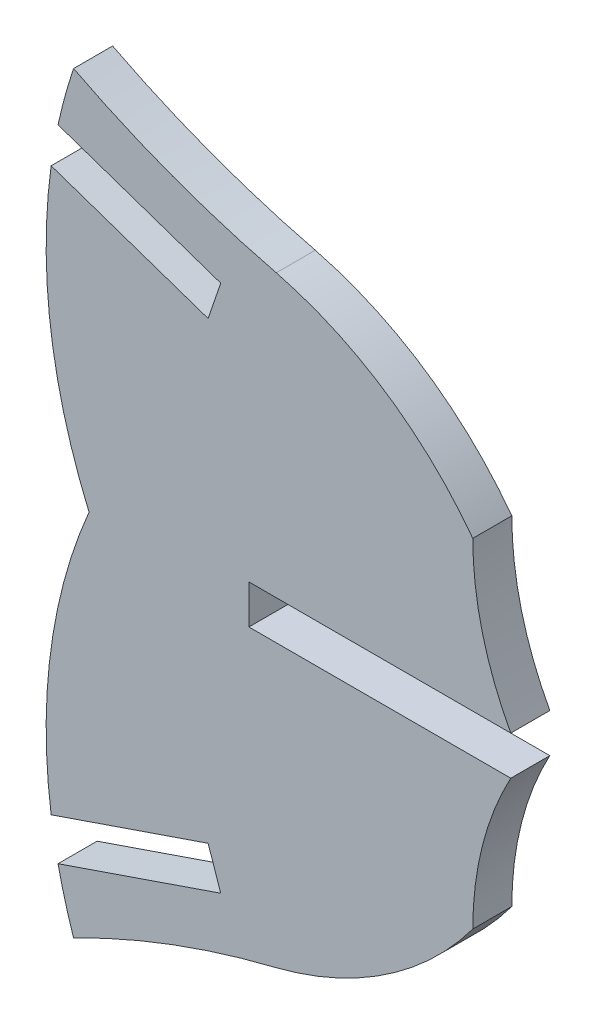
ISO-10303-21;
HEADER;
FILE_DESCRIPTION(('STEP AP214'),'2;1');
FILE_NAME('part.step','',(''),(''),'','','');
FILE_SCHEMA(('AUTOMOTIVE_DESIGN { 1 0 10303 214 1 1 1 1 }'));
ENDSEC;
DATA;
#1=APPLICATION_CONTEXT('core data for automotive mechanical design processes');
#2=APPLICATION_PROTOCOL_DEFINITION('international standard','automotive_design',2000,#1);
#3=PRODUCT_CONTEXT('',#1,'mechanical');
#4=PRODUCT('Part','Part','',(#3));
#5=PRODUCT_RELATED_PRODUCT_CATEGORY('part','',(#4));
#6=PRODUCT_DEFINITION_FORMATION('','',#4);
#7=PRODUCT_DEFINITION_CONTEXT('part definition',#1,'design');
#8=PRODUCT_DEFINITION('design','',#6,#7);
#9=PRODUCT_DEFINITION_SHAPE('','',#8);
#10=(LENGTH_UNIT() NAMED_UNIT(*) SI_UNIT(.MILLI.,.METRE.));
#11=(NAMED_UNIT(*) PLANE_ANGLE_UNIT() SI_UNIT($,.RADIAN.));
#12=(NAMED_UNIT(*) SI_UNIT($,.STERADIAN.) SOLID_ANGLE_UNIT());
#13=UNCERTAINTY_MEASURE_WITH_UNIT(LENGTH_MEASURE(1.E-05),#10,'distance_accuracy_value','');
#14=(GEOMETRIC_REPRESENTATION_CONTEXT(3) GLOBAL_UNCERTAINTY_ASSIGNED_CONTEXT((#13)) GLOBAL_UNIT_ASSIGNED_CONTEXT((#10,
#11,#12)) REPRESENTATION_CONTEXT('',''));
#15=CARTESIAN_POINT('',(0.,0.,0.));
#16=DIRECTION('',(0.,0.,1.));
#17=DIRECTION('',(1.,0.,0.));
#18=AXIS2_PLACEMENT_3D('',#15,#16,#17);
#19=CARTESIAN_POINT('',(0.285426681727199,0.,1.524));
#20=DIRECTION('',(0.,1.,0.));
#21=DIRECTION('',(-1.,0.,0.));
#22=AXIS2_PLACEMENT_3D('',#19,#20,#21);
#23=PLANE('',#22);
#24=DIRECTION('',(1.,0.,0.));
#25=VECTOR('',#24,1.);
#26=CARTESIAN_POINT('',(0.285426681727199,0.,0.));
#27=LINE('',#26,#25);
#28=CARTESIAN_POINT('',(0.285426681727199,0.,0.));
#29=VERTEX_POINT('',#28);
#30=CARTESIAN_POINT('',(10.5084019228627,0.,0.));
#31=VERTEX_POINT('',#30);
#32=EDGE_CURVE('E195',#29,#31,#27,.T.);
#33=ORIENTED_EDGE('',*,*,#32,.T.);
#34=DIRECTION('',(0.,0.,-1.));
#35=VECTOR('',#34,1.);
#36=CARTESIAN_POINT('',(10.5084019228627,0.,1.524));
#37=LINE('',#36,#35);
#38=CARTESIAN_POINT('',(10.5084019228627,0.,1.524));
#39=VERTEX_POINT('',#38);
#40=EDGE_CURVE('E11',#39,#31,#37,.T.);
#41=ORIENTED_EDGE('',*,*,#40,.F.);
#42=DIRECTION('',(1.,0.,0.));
#43=VECTOR('',#42,1.);
#44=CARTESIAN_POINT('',(0.285426681727199,0.,1.524));
#45=LINE('',#44,#43);
#46=CARTESIAN_POINT('',(0.285426681727199,0.,1.524));
#47=VERTEX_POINT('',#46);
#48=EDGE_CURVE('E231',#47,#39,#45,.T.);
#49=ORIENTED_EDGE('',*,*,#48,.F.);
#50=DIRECTION('',(0.,0.,-1.));
#51=VECTOR('',#50,1.);
#52=CARTESIAN_POINT('',(0.285426681727199,0.,1.524));
#53=LINE('',#52,#51);
#54=EDGE_CURVE('E191',#47,#29,#53,.T.);
#55=ORIENTED_EDGE('',*,*,#54,.T.);
#56=EDGE_LOOP('',(#33,#41,#49,#55));
#57=FACE_BOUND('',#56,.T.);
#58=ADVANCED_FACE('F33',(#57),#23,.F.);
#59=CARTESIAN_POINT('',(21.2674310646447,5.84217819092027,1.524));
#60=DIRECTION('',(0.,0.,-1.));
#61=DIRECTION('',(-1.,0.,0.));
#62=AXIS2_PLACEMENT_3D('',#59,#60,#61);
#63=CYLINDRICAL_SURFACE('',#62,12.2428654361705);
#64=CARTESIAN_POINT('',(21.2674310646447,5.84217819092027,0.));
#65=DIRECTION('',(0.,0.,-1.));
#66=DIRECTION('',(-1.,0.,0.));
#67=AXIS2_PLACEMENT_3D('',#64,#65,#66);
#68=CIRCLE('',#67,12.2428654361705);
#69=CARTESIAN_POINT('',(9.0245656284742,5.84217819092036,0.));
#70=VERTEX_POINT('',#69);
#71=EDGE_CURVE('E198',#31,#70,#68,.T.);
#72=ORIENTED_EDGE('',*,*,#71,.T.);
#73=DIRECTION('',(0.,0.,-1.));
#74=VECTOR('',#73,1.);
#75=CARTESIAN_POINT('',(9.0245656284742,5.84217819092036,1.524));
#76=LINE('',#75,#74);
#77=CARTESIAN_POINT('',(9.0245656284742,5.84217819092036,1.524));
#78=VERTEX_POINT('',#77);
#79=EDGE_CURVE('E41',#78,#70,#76,.T.);
#80=ORIENTED_EDGE('',*,*,#79,.F.);
#81=CARTESIAN_POINT('',(21.2674310646447,5.84217819092027,1.524));
#82=DIRECTION('',(0.,0.,-1.));
#83=DIRECTION('',(-1.,0.,0.));
#84=AXIS2_PLACEMENT_3D('',#81,#82,#83);
#85=CIRCLE('',#84,12.2428654361705);
#86=EDGE_CURVE('E125',#39,#78,#85,.T.);
#87=ORIENTED_EDGE('',*,*,#86,.F.);
#88=ORIENTED_EDGE('',*,*,#40,.T.);
#89=EDGE_LOOP('',(#72,#80,#87,#88));
#90=FACE_BOUND('',#89,.T.);
#91=ADVANCED_FACE('F344',(#90),#63,.F.);
#92=CARTESIAN_POINT('',(-2.04585475702059,-2.37697347672963,1.524));
#93=DIRECTION('',(0.,0.,-1.));
#94=DIRECTION('',(-1.,0.,0.));
#95=AXIS2_PLACEMENT_3D('',#92,#93,#94);
#96=CYLINDRICAL_SURFACE('',#95,13.7879897609264);
#97=CARTESIAN_POINT('',(-2.04585475702059,-2.37697347672963,0.));
#98=DIRECTION('',(0.,0.,1.));
#99=DIRECTION('',(-1.,0.,0.));
#100=AXIS2_PLACEMENT_3D('',#97,#98,#99);
#101=CIRCLE('',#100,13.7879897609264);
#102=CARTESIAN_POINT('',(1.35365075137161,10.9853625445588,0.));
#103=VERTEX_POINT('',#102);
#104=EDGE_CURVE('E200',#70,#103,#101,.T.);
#105=ORIENTED_EDGE('',*,*,#104,.T.);
#106=DIRECTION('',(0.,0.,-1.));
#107=VECTOR('',#106,1.);
#108=CARTESIAN_POINT('',(1.35365075137161,10.9853625445588,1.524));
#109=LINE('',#108,#107);
#110=CARTESIAN_POINT('',(1.35365075137161,10.9853625445588,1.524));
#111=VERTEX_POINT('',#110);
#112=EDGE_CURVE('E271',#111,#103,#109,.T.);
#113=ORIENTED_EDGE('',*,*,#112,.F.);
#114=CARTESIAN_POINT('',(-2.04585475702059,-2.37697347672963,1.524));
#115=DIRECTION('',(0.,0.,1.));
#116=DIRECTION('',(-1.,0.,0.));
#117=AXIS2_PLACEMENT_3D('',#114,#115,#116);
#118=CIRCLE('',#117,13.7879897609264);
#119=EDGE_CURVE('E279',#78,#111,#118,.T.);
#120=ORIENTED_EDGE('',*,*,#119,.F.);
#121=ORIENTED_EDGE('',*,*,#79,.T.);
#122=EDGE_LOOP('',(#105,#113,#120,#121));
#123=FACE_BOUND('',#122,.T.);
#124=ADVANCED_FACE('F277',(#123),#96,.T.);
#125=CARTESIAN_POINT('',(9.96398661820152,46.1957399070621,1.524));
#126=DIRECTION('',(0.,0.,-1.));
#127=DIRECTION('',(-1.,0.,0.));
#128=AXIS2_PLACEMENT_3D('',#125,#126,#127);
#129=CYLINDRICAL_SURFACE('',#128,36.2478765964229);
#130=CARTESIAN_POINT('',(9.96398661820152,46.1957399070621,0.));
#131=DIRECTION('',(0.,0.,-1.));
#132=DIRECTION('',(1.,0.,0.));
#133=AXIS2_PLACEMENT_3D('',#130,#131,#132);
#134=CIRCLE('',#133,36.2478765964229);
#135=CARTESIAN_POINT('',(-6.55922440239465,13.9328811478271,0.));
#136=VERTEX_POINT('',#135);
#137=EDGE_CURVE('E202',#103,#136,#134,.T.);
#138=ORIENTED_EDGE('',*,*,#137,.T.);
#139=DIRECTION('',(0.,0.,-1.));
#140=VECTOR('',#139,1.);
#141=CARTESIAN_POINT('',(-6.55922440239465,13.9328811478271,1.524));
#142=LINE('',#141,#140);
#143=CARTESIAN_POINT('',(-6.55922440239465,13.9328811478271,1.524));
#144=VERTEX_POINT('',#143);
#145=EDGE_CURVE('E268',#144,#136,#142,.T.);
#146=ORIENTED_EDGE('',*,*,#145,.F.);
#147=CARTESIAN_POINT('',(9.96398661820152,46.1957399070621,1.524));
#148=DIRECTION('',(0.,0.,-1.));
#149=DIRECTION('',(1.,0.,0.));
#150=AXIS2_PLACEMENT_3D('',#147,#148,#149);
#151=CIRCLE('',#150,36.2478765964229);
#152=EDGE_CURVE('E297',#111,#144,#151,.T.);
#153=ORIENTED_EDGE('',*,*,#152,.F.);
#154=ORIENTED_EDGE('',*,*,#112,.T.);
#155=EDGE_LOOP('',(#138,#146,#153,#154));
#156=FACE_BOUND('',#155,.T.);
#157=ADVANCED_FACE('F288',(#156),#129,.F.);
#158=CARTESIAN_POINT('',(12.9854145326521,7.37668259635203,1.524));
#159=DIRECTION('',(0.,0.,-1.));
#160=DIRECTION('',(-1.,0.,0.));
#161=AXIS2_PLACEMENT_3D('',#158,#159,#160);
#162=CYLINDRICAL_SURFACE('',#161,20.6149618129093);
#163=CARTESIAN_POINT('',(12.9854145326521,7.37668259635203,0.));
#164=DIRECTION('',(0.,0.,1.));
#165=DIRECTION('',(1.,0.,0.));
#166=AXIS2_PLACEMENT_3D('',#163,#164,#165);
#167=CIRCLE('',#166,20.6149618129093);
#168=CARTESIAN_POINT('',(-7.16516219998669,11.727648913131,0.));
#169=VERTEX_POINT('',#168);
#170=EDGE_CURVE('E204',#136,#169,#167,.T.);
#171=ORIENTED_EDGE('',*,*,#170,.T.);
#172=DIRECTION('',(0.,0.,-1.));
#173=VECTOR('',#172,1.);
#174=CARTESIAN_POINT('',(-7.16516219998669,11.727648913131,1.524));
#175=LINE('',#174,#173);
#176=CARTESIAN_POINT('',(-7.16516219998669,11.727648913131,1.524));
#177=VERTEX_POINT('',#176);
#178=EDGE_CURVE('E265',#177,#169,#175,.T.);
#179=ORIENTED_EDGE('',*,*,#178,.F.);
#180=CARTESIAN_POINT('',(12.9854145326521,7.37668259635203,1.524));
#181=DIRECTION('',(0.,0.,1.));
#182=DIRECTION('',(1.,0.,0.));
#183=AXIS2_PLACEMENT_3D('',#180,#181,#182);
#184=CIRCLE('',#183,20.6149618129093);
#185=EDGE_CURVE('E294',#144,#177,#184,.T.);
#186=ORIENTED_EDGE('',*,*,#185,.F.);
#187=ORIENTED_EDGE('',*,*,#145,.T.);
#188=EDGE_LOOP('',(#171,#179,#186,#187));
#189=FACE_BOUND('',#188,.T.);
#190=ADVANCED_FACE('F292',(#189),#162,.T.);
#191=CARTESIAN_POINT('',(-7.16516219998669,11.727648913131,1.524));
#192=DIRECTION('',(0.324231129631645,0.945977893281755,0.));
#193=DIRECTION('',(-0.945977893281755,0.324231129631645,0.));
#194=AXIS2_PLACEMENT_3D('',#191,#192,#193);
#195=PLANE('',#194);
#196=DIRECTION('',(0.945977893281755,-0.324231129631645,0.));
#197=VECTOR('',#196,1.);
#198=CARTESIAN_POINT('',(-7.16516219998669,11.727648913131,0.));
#199=LINE('',#198,#197);
#200=CARTESIAN_POINT('',(-0.813548274939549,9.55065199541469,0.));
#201=VERTEX_POINT('',#200);
#202=EDGE_CURVE('E206',#169,#201,#199,.T.);
#203=ORIENTED_EDGE('',*,*,#202,.T.);
#204=DIRECTION('',(0.,0.,-1.));
#205=VECTOR('',#204,1.);
#206=CARTESIAN_POINT('',(-0.813548274939549,9.55065199541469,1.524));
#207=LINE('',#206,#205);
#208=CARTESIAN_POINT('',(-0.813548274939549,9.55065199541469,1.524));
#209=VERTEX_POINT('',#208);
#210=EDGE_CURVE('E262',#209,#201,#207,.T.);
#211=ORIENTED_EDGE('',*,*,#210,.F.);
#212=DIRECTION('',(0.945977893281755,-0.324231129631645,0.));
#213=VECTOR('',#212,1.);
#214=CARTESIAN_POINT('',(-7.16516219998669,11.727648913131,1.524));
#215=LINE('',#214,#213);
#216=EDGE_CURVE('E296',#177,#209,#215,.T.);
#217=ORIENTED_EDGE('',*,*,#216,.F.);
#218=ORIENTED_EDGE('',*,*,#178,.T.);
#219=EDGE_LOOP('',(#203,#211,#217,#218));
#220=FACE_BOUND('',#219,.T.);
#221=ADVANCED_FACE('F357',(#220),#195,.F.);
#222=CARTESIAN_POINT('',(-0.813548274939549,9.55065199541469,1.524));
#223=DIRECTION('',(0.945977893281755,-0.324231129631645,0.));
#224=DIRECTION('',(0.324231129631645,0.945977893281755,0.));
#225=AXIS2_PLACEMENT_3D('',#222,#223,#224);
#226=PLANE('',#225);
#227=DIRECTION('',(-0.324231129631645,-0.945977893281755,0.));
#228=VECTOR('',#227,1.);
#229=CARTESIAN_POINT('',(-0.813548274939549,9.55065199541469,0.));
#230=LINE('',#229,#228);
#231=CARTESIAN_POINT('',(-1.30767651649818,8.1089816860533,0.));
#232=VERTEX_POINT('',#231);
#233=EDGE_CURVE('E208',#201,#232,#230,.T.);
#234=ORIENTED_EDGE('',*,*,#233,.T.);
#235=DIRECTION('',(0.,0.,-1.));
#236=VECTOR('',#235,1.);
#237=CARTESIAN_POINT('',(-1.30767651649818,8.1089816860533,1.524));
#238=LINE('',#237,#236);
#239=CARTESIAN_POINT('',(-1.30767651649818,8.1089816860533,1.524));
#240=VERTEX_POINT('',#239);
#241=EDGE_CURVE('E259',#240,#232,#238,.T.);
#242=ORIENTED_EDGE('',*,*,#241,.F.);
#243=DIRECTION('',(-0.324231129631645,-0.945977893281755,0.));
#244=VECTOR('',#243,1.);
#245=CARTESIAN_POINT('',(-0.813548274939549,9.55065199541469,1.524));
#246=LINE('',#245,#244);
#247=EDGE_CURVE('E299',#209,#240,#246,.T.);
#248=ORIENTED_EDGE('',*,*,#247,.F.);
#249=ORIENTED_EDGE('',*,*,#210,.T.);
#250=EDGE_LOOP('',(#234,#242,#248,#249));
#251=FACE_BOUND('',#250,.T.);
#252=ADVANCED_FACE('F360',(#251),#226,.F.);
#253=CARTESIAN_POINT('',(-7.4340816445076,10.2087889535831,1.524));
#254=DIRECTION('',(-0.324231129631645,-0.945977893281755,0.));
#255=DIRECTION('',(0.945977893281755,-0.324231129631645,0.));
#256=AXIS2_PLACEMENT_3D('',#253,#254,#255);
#257=PLANE('',#256);
#258=DIRECTION('',(-0.945977893281755,0.324231129631645,0.));
#259=VECTOR('',#258,1.);
#260=CARTESIAN_POINT('',(-7.4340816445076,10.2087889535831,0.));
#261=LINE('',#260,#259);
#262=CARTESIAN_POINT('',(-7.4340816445076,10.2087889535831,0.));
#263=VERTEX_POINT('',#262);
#264=EDGE_CURVE('E210',#232,#263,#261,.T.);
#265=ORIENTED_EDGE('',*,*,#264,.T.);
#266=DIRECTION('',(0.,0.,-1.));
#267=VECTOR('',#266,1.);
#268=CARTESIAN_POINT('',(-7.4340816445076,10.2087889535831,1.524));
#269=LINE('',#268,#267);
#270=CARTESIAN_POINT('',(-7.4340816445076,10.2087889535831,1.524));
#271=VERTEX_POINT('',#270);
#272=EDGE_CURVE('E256',#271,#263,#269,.T.);
#273=ORIENTED_EDGE('',*,*,#272,.F.);
#274=DIRECTION('',(-0.945977893281755,0.324231129631645,0.));
#275=VECTOR('',#274,1.);
#276=CARTESIAN_POINT('',(-7.4340816445076,10.2087889535831,1.524));
#277=LINE('',#276,#275);
#278=EDGE_CURVE('E305',#240,#271,#277,.T.);
#279=ORIENTED_EDGE('',*,*,#278,.F.);
#280=ORIENTED_EDGE('',*,*,#241,.T.);
#281=EDGE_LOOP('',(#265,#273,#279,#280));
#282=FACE_BOUND('',#281,.T.);
#283=ADVANCED_FACE('F364',(#282),#257,.F.);
#284=CARTESIAN_POINT('',(12.9854145326521,7.37668259635203,1.524));
#285=DIRECTION('',(0.,0.,-1.));
#286=DIRECTION('',(-1.,0.,0.));
#287=AXIS2_PLACEMENT_3D('',#284,#285,#286);
#288=CYLINDRICAL_SURFACE('',#287,20.6149618129093);
#289=CARTESIAN_POINT('',(12.9854145326521,7.37668259635203,0.));
#290=DIRECTION('',(0.,0.,1.));
#291=DIRECTION('',(1.,0.,0.));
#292=AXIS2_PLACEMENT_3D('',#289,#290,#291);
#293=CIRCLE('',#292,20.6149618129093);
#294=CARTESIAN_POINT('',(-5.9549787088713,-0.762000000000002,0.));
#295=VERTEX_POINT('',#294);
#296=EDGE_CURVE('E212',#263,#295,#293,.T.);
#297=ORIENTED_EDGE('',*,*,#296,.T.);
#298=DIRECTION('',(0.,0.,-1.));
#299=VECTOR('',#298,1.);
#300=CARTESIAN_POINT('',(-5.9549787088713,-0.762000000000002,1.524));
#301=LINE('',#300,#299);
#302=CARTESIAN_POINT('',(-5.9549787088713,-0.762000000000002,1.524));
#303=VERTEX_POINT('',#302);
#304=EDGE_CURVE('E253',#303,#295,#301,.T.);
#305=ORIENTED_EDGE('',*,*,#304,.F.);
#306=CARTESIAN_POINT('',(12.9854145326521,7.37668259635203,1.524));
#307=DIRECTION('',(0.,0.,1.));
#308=DIRECTION('',(1.,0.,0.));
#309=AXIS2_PLACEMENT_3D('',#306,#307,#308);
#310=CIRCLE('',#309,20.6149618129093);
#311=EDGE_CURVE('E307',#271,#303,#310,.T.);
#312=ORIENTED_EDGE('',*,*,#311,.F.);
#313=ORIENTED_EDGE('',*,*,#272,.T.);
#314=EDGE_LOOP('',(#297,#305,#312,#313));
#315=FACE_BOUND('',#314,.T.);
#316=ADVANCED_FACE('F368',(#315),#288,.T.);
#317=CARTESIAN_POINT('',(12.9854145326521,-8.90068259635203,1.524));
#318=DIRECTION('',(0.,0.,-1.));
#319=DIRECTION('',(-1.,0.,0.));
#320=AXIS2_PLACEMENT_3D('',#317,#318,#319);
#321=CYLINDRICAL_SURFACE('',#320,20.6149618129093);
#322=CARTESIAN_POINT('',(12.9854145326521,-8.90068259635203,0.));
#323=DIRECTION('',(0.,0.,1.));
#324=DIRECTION('',(-1.,0.,0.));
#325=AXIS2_PLACEMENT_3D('',#322,#323,#324);
#326=CIRCLE('',#325,20.6149618129093);
#327=CARTESIAN_POINT('',(-7.4340816445076,-11.7327889535831,0.));
#328=VERTEX_POINT('',#327);
#329=EDGE_CURVE('E214',#295,#328,#326,.T.);
#330=ORIENTED_EDGE('',*,*,#329,.T.);
#331=DIRECTION('',(0.,0.,-1.));
#332=VECTOR('',#331,1.);
#333=CARTESIAN_POINT('',(-7.4340816445076,-11.7327889535831,1.524));
#334=LINE('',#333,#332);
#335=CARTESIAN_POINT('',(-7.4340816445076,-11.7327889535831,1.524));
#336=VERTEX_POINT('',#335);
#337=EDGE_CURVE('E250',#336,#328,#334,.T.);
#338=ORIENTED_EDGE('',*,*,#337,.F.);
#339=CARTESIAN_POINT('',(12.9854145326521,-8.90068259635203,1.524));
#340=DIRECTION('',(0.,0.,1.));
#341=DIRECTION('',(-1.,0.,0.));
#342=AXIS2_PLACEMENT_3D('',#339,#340,#341);
#343=CIRCLE('',#342,20.6149618129093);
#344=EDGE_CURVE('E309',#303,#336,#343,.T.);
#345=ORIENTED_EDGE('',*,*,#344,.F.);
#346=ORIENTED_EDGE('',*,*,#304,.T.);
#347=EDGE_LOOP('',(#330,#338,#345,#346));
#348=FACE_BOUND('',#347,.T.);
#349=ADVANCED_FACE('F372',(#348),#321,.T.);
#350=CARTESIAN_POINT('',(-7.4340816445076,-11.7327889535831,1.524));
#351=DIRECTION('',(-0.324231129631645,0.945977893281755,0.));
#352=DIRECTION('',(-0.945977893281755,-0.324231129631645,0.));
#353=AXIS2_PLACEMENT_3D('',#350,#351,#352);
#354=PLANE('',#353);
#355=DIRECTION('',(0.945977893281755,0.324231129631645,0.));
#356=VECTOR('',#355,1.);
#357=CARTESIAN_POINT('',(-7.4340816445076,-11.7327889535831,0.));
#358=LINE('',#357,#356);
#359=CARTESIAN_POINT('',(-1.30767651649818,-9.6329816860533,0.));
#360=VERTEX_POINT('',#359);
#361=EDGE_CURVE('E216',#328,#360,#358,.T.);
#362=ORIENTED_EDGE('',*,*,#361,.T.);
#363=DIRECTION('',(0.,0.,-1.));
#364=VECTOR('',#363,1.);
#365=CARTESIAN_POINT('',(-1.30767651649818,-9.6329816860533,1.524));
#366=LINE('',#365,#364);
#367=CARTESIAN_POINT('',(-1.30767651649818,-9.6329816860533,1.524));
#368=VERTEX_POINT('',#367);
#369=EDGE_CURVE('E247',#368,#360,#366,.T.);
#370=ORIENTED_EDGE('',*,*,#369,.F.);
#371=DIRECTION('',(0.945977893281755,0.324231129631645,0.));
#372=VECTOR('',#371,1.);
#373=CARTESIAN_POINT('',(-7.4340816445076,-11.7327889535831,1.524));
#374=LINE('',#373,#372);
#375=EDGE_CURVE('E311',#336,#368,#374,.T.);
#376=ORIENTED_EDGE('',*,*,#375,.F.);
#377=ORIENTED_EDGE('',*,*,#337,.T.);
#378=EDGE_LOOP('',(#362,#370,#376,#377));
#379=FACE_BOUND('',#378,.T.);
#380=ADVANCED_FACE('F376',(#379),#354,.F.);
#381=CARTESIAN_POINT('',(-0.813548274939549,-11.0746519954147,1.524));
#382=DIRECTION('',(0.945977893281755,0.324231129631645,0.));
#383=DIRECTION('',(-0.324231129631645,0.945977893281755,0.));
#384=AXIS2_PLACEMENT_3D('',#381,#382,#383);
#385=PLANE('',#384);
#386=DIRECTION('',(0.324231129631645,-0.945977893281755,0.));
#387=VECTOR('',#386,1.);
#388=CARTESIAN_POINT('',(-0.813548274939549,-11.0746519954147,0.));
#389=LINE('',#388,#387);
#390=CARTESIAN_POINT('',(-0.813548274939549,-11.0746519954147,0.));
#391=VERTEX_POINT('',#390);
#392=EDGE_CURVE('E218',#360,#391,#389,.T.);
#393=ORIENTED_EDGE('',*,*,#392,.T.);
#394=DIRECTION('',(0.,0.,-1.));
#395=VECTOR('',#394,1.);
#396=CARTESIAN_POINT('',(-0.813548274939549,-11.0746519954147,1.524));
#397=LINE('',#396,#395);
#398=CARTESIAN_POINT('',(-0.813548274939549,-11.0746519954147,1.524));
#399=VERTEX_POINT('',#398);
#400=EDGE_CURVE('E244',#399,#391,#397,.T.);
#401=ORIENTED_EDGE('',*,*,#400,.F.);
#402=DIRECTION('',(0.324231129631645,-0.945977893281755,0.));
#403=VECTOR('',#402,1.);
#404=CARTESIAN_POINT('',(-0.813548274939549,-11.0746519954147,1.524));
#405=LINE('',#404,#403);
#406=EDGE_CURVE('E313',#368,#399,#405,.T.);
#407=ORIENTED_EDGE('',*,*,#406,.F.);
#408=ORIENTED_EDGE('',*,*,#369,.T.);
#409=EDGE_LOOP('',(#393,#401,#407,#408));
#410=FACE_BOUND('',#409,.T.);
#411=ADVANCED_FACE('F380',(#410),#385,.F.);
#412=CARTESIAN_POINT('',(-7.16516219998669,-13.251648913131,1.524));
#413=DIRECTION('',(0.324231129631645,-0.945977893281755,0.));
#414=DIRECTION('',(0.945977893281755,0.324231129631645,0.));
#415=AXIS2_PLACEMENT_3D('',#412,#413,#414);
#416=PLANE('',#415);
#417=DIRECTION('',(-0.945977893281755,-0.324231129631645,0.));
#418=VECTOR('',#417,1.);
#419=CARTESIAN_POINT('',(-7.16516219998669,-13.251648913131,0.));
#420=LINE('',#419,#418);
#421=CARTESIAN_POINT('',(-7.16516219998669,-13.251648913131,0.));
#422=VERTEX_POINT('',#421);
#423=EDGE_CURVE('E220',#391,#422,#420,.T.);
#424=ORIENTED_EDGE('',*,*,#423,.T.);
#425=DIRECTION('',(0.,0.,-1.));
#426=VECTOR('',#425,1.);
#427=CARTESIAN_POINT('',(-7.16516219998669,-13.251648913131,1.524));
#428=LINE('',#427,#426);
#429=CARTESIAN_POINT('',(-7.16516219998669,-13.251648913131,1.524));
#430=VERTEX_POINT('',#429);
#431=EDGE_CURVE('E241',#430,#422,#428,.T.);
#432=ORIENTED_EDGE('',*,*,#431,.F.);
#433=DIRECTION('',(-0.945977893281755,-0.324231129631645,0.));
#434=VECTOR('',#433,1.);
#435=CARTESIAN_POINT('',(-7.16516219998669,-13.251648913131,1.524));
#436=LINE('',#435,#434);
#437=EDGE_CURVE('E315',#399,#430,#436,.T.);
#438=ORIENTED_EDGE('',*,*,#437,.F.);
#439=ORIENTED_EDGE('',*,*,#400,.T.);
#440=EDGE_LOOP('',(#424,#432,#438,#439));
#441=FACE_BOUND('',#440,.T.);
#442=ADVANCED_FACE('F384',(#441),#416,.F.);
#443=CARTESIAN_POINT('',(12.9854145326521,-8.90068259635203,1.524));
#444=DIRECTION('',(0.,0.,-1.));
#445=DIRECTION('',(-1.,0.,0.));
#446=AXIS2_PLACEMENT_3D('',#443,#444,#445);
#447=CYLINDRICAL_SURFACE('',#446,20.6149618129093);
#448=CARTESIAN_POINT('',(12.9854145326521,-8.90068259635203,0.));
#449=DIRECTION('',(0.,0.,1.));
#450=DIRECTION('',(-1.,0.,0.));
#451=AXIS2_PLACEMENT_3D('',#448,#449,#450);
#452=CIRCLE('',#451,20.6149618129093);
#453=CARTESIAN_POINT('',(-6.55922440239464,-15.4568811478271,0.));
#454=VERTEX_POINT('',#453);
#455=EDGE_CURVE('E222',#422,#454,#452,.T.);
#456=ORIENTED_EDGE('',*,*,#455,.T.);
#457=DIRECTION('',(0.,0.,-1.));
#458=VECTOR('',#457,1.);
#459=CARTESIAN_POINT('',(-6.55922440239464,-15.4568811478271,1.524));
#460=LINE('',#459,#458);
#461=CARTESIAN_POINT('',(-6.55922440239464,-15.4568811478271,1.524));
#462=VERTEX_POINT('',#461);
#463=EDGE_CURVE('E238',#462,#454,#460,.T.);
#464=ORIENTED_EDGE('',*,*,#463,.F.);
#465=CARTESIAN_POINT('',(12.9854145326521,-8.90068259635203,1.524));
#466=DIRECTION('',(0.,0.,1.));
#467=DIRECTION('',(-1.,0.,0.));
#468=AXIS2_PLACEMENT_3D('',#465,#466,#467);
#469=CIRCLE('',#468,20.6149618129093);
#470=EDGE_CURVE('E317',#430,#462,#469,.T.);
#471=ORIENTED_EDGE('',*,*,#470,.F.);
#472=ORIENTED_EDGE('',*,*,#431,.T.);
#473=EDGE_LOOP('',(#456,#464,#471,#472));
#474=FACE_BOUND('',#473,.T.);
#475=ADVANCED_FACE('F388',(#474),#447,.T.);
#476=CARTESIAN_POINT('',(9.96398661820152,-47.7197399070621,1.524));
#477=DIRECTION('',(0.,0.,-1.));
#478=DIRECTION('',(-1.,0.,0.));
#479=AXIS2_PLACEMENT_3D('',#476,#477,#478);
#480=CYLINDRICAL_SURFACE('',#479,36.2478765964228);
#481=CARTESIAN_POINT('',(9.96398661820152,-47.7197399070621,0.));
#482=DIRECTION('',(0.,0.,-1.));
#483=DIRECTION('',(-1.,0.,0.));
#484=AXIS2_PLACEMENT_3D('',#481,#482,#483);
#485=CIRCLE('',#484,36.2478765964228);
#486=CARTESIAN_POINT('',(1.35365075137161,-12.5093625445588,0.));
#487=VERTEX_POINT('',#486);
#488=EDGE_CURVE('E224',#454,#487,#485,.T.);
#489=ORIENTED_EDGE('',*,*,#488,.T.);
#490=DIRECTION('',(0.,0.,-1.));
#491=VECTOR('',#490,1.);
#492=CARTESIAN_POINT('',(1.35365075137161,-12.5093625445588,1.524));
#493=LINE('',#492,#491);
#494=CARTESIAN_POINT('',(1.35365075137161,-12.5093625445588,1.524));
#495=VERTEX_POINT('',#494);
#496=EDGE_CURVE('E235',#495,#487,#493,.T.);
#497=ORIENTED_EDGE('',*,*,#496,.F.);
#498=CARTESIAN_POINT('',(9.96398661820152,-47.7197399070621,1.524));
#499=DIRECTION('',(0.,0.,-1.));
#500=DIRECTION('',(-1.,0.,0.));
#501=AXIS2_PLACEMENT_3D('',#498,#499,#500);
#502=CIRCLE('',#501,36.2478765964228);
#503=EDGE_CURVE('E319',#462,#495,#502,.T.);
#504=ORIENTED_EDGE('',*,*,#503,.F.);
#505=ORIENTED_EDGE('',*,*,#463,.T.);
#506=EDGE_LOOP('',(#489,#497,#504,#505));
#507=FACE_BOUND('',#506,.T.);
#508=ADVANCED_FACE('F325',(#507),#480,.F.);
#509=CARTESIAN_POINT('',(-2.04585475702059,0.852973476729626,1.524));
#510=DIRECTION('',(0.,0.,-1.));
#511=DIRECTION('',(-1.,0.,0.));
#512=AXIS2_PLACEMENT_3D('',#509,#510,#511);
#513=CYLINDRICAL_SURFACE('',#512,13.7879897609264);
#514=CARTESIAN_POINT('',(-2.04585475702059,0.852973476729626,0.));
#515=DIRECTION('',(0.,0.,1.));
#516=DIRECTION('',(1.,0.,0.));
#517=AXIS2_PLACEMENT_3D('',#514,#515,#516);
#518=CIRCLE('',#517,13.7879897609264);
#519=CARTESIAN_POINT('',(9.0245656284742,-7.36617819092036,0.));
#520=VERTEX_POINT('',#519);
#521=EDGE_CURVE('E226',#487,#520,#518,.T.);
#522=ORIENTED_EDGE('',*,*,#521,.T.);
#523=DIRECTION('',(0.,0.,-1.));
#524=VECTOR('',#523,1.);
#525=CARTESIAN_POINT('',(9.0245656284742,-7.36617819092036,1.524));
#526=LINE('',#525,#524);
#527=CARTESIAN_POINT('',(9.0245656284742,-7.36617819092036,1.524));
#528=VERTEX_POINT('',#527);
#529=EDGE_CURVE('E186',#528,#520,#526,.T.);
#530=ORIENTED_EDGE('',*,*,#529,.F.);
#531=CARTESIAN_POINT('',(-2.04585475702059,0.852973476729626,1.524));
#532=DIRECTION('',(0.,0.,1.));
#533=DIRECTION('',(1.,0.,0.));
#534=AXIS2_PLACEMENT_3D('',#531,#532,#533);
#535=CIRCLE('',#534,13.7879897609264);
#536=EDGE_CURVE('E177',#495,#528,#535,.T.);
#537=ORIENTED_EDGE('',*,*,#536,.F.);
#538=ORIENTED_EDGE('',*,*,#496,.T.);
#539=EDGE_LOOP('',(#522,#530,#537,#538));
#540=FACE_BOUND('',#539,.T.);
#541=ADVANCED_FACE('F329',(#540),#513,.T.);
#542=CARTESIAN_POINT('',(21.2674310646447,-7.36617819092027,1.524));
#543=DIRECTION('',(0.,0.,-1.));
#544=DIRECTION('',(-1.,0.,0.));
#545=AXIS2_PLACEMENT_3D('',#542,#543,#544);
#546=CYLINDRICAL_SURFACE('',#545,12.2428654361705);
#547=CARTESIAN_POINT('',(21.2674310646447,-7.36617819092027,0.));
#548=DIRECTION('',(0.,0.,-1.));
#549=DIRECTION('',(1.,0.,0.));
#550=AXIS2_PLACEMENT_3D('',#547,#548,#549);
#551=CIRCLE('',#550,12.2428654361705);
#552=CARTESIAN_POINT('',(10.5084019228627,-1.524,0.));
#553=VERTEX_POINT('',#552);
#554=EDGE_CURVE('E185',#520,#553,#551,.T.);
#555=ORIENTED_EDGE('',*,*,#554,.T.);
#556=DIRECTION('',(0.,0.,-1.));
#557=VECTOR('',#556,1.);
#558=CARTESIAN_POINT('',(10.5084019228627,-1.524,1.524));
#559=LINE('',#558,#557);
#560=CARTESIAN_POINT('',(10.5084019228627,-1.524,1.524));
#561=VERTEX_POINT('',#560);
#562=EDGE_CURVE('E182',#561,#553,#559,.T.);
#563=ORIENTED_EDGE('',*,*,#562,.F.);
#564=CARTESIAN_POINT('',(21.2674310646447,-7.36617819092027,1.524));
#565=DIRECTION('',(0.,0.,-1.));
#566=DIRECTION('',(1.,0.,0.));
#567=AXIS2_PLACEMENT_3D('',#564,#565,#566);
#568=CIRCLE('',#567,12.2428654361705);
#569=EDGE_CURVE('E171',#528,#561,#568,.T.);
#570=ORIENTED_EDGE('',*,*,#569,.F.);
#571=ORIENTED_EDGE('',*,*,#529,.T.);
#572=EDGE_LOOP('',(#555,#563,#570,#571));
#573=FACE_BOUND('',#572,.T.);
#574=ADVANCED_FACE('F183',(#573),#546,.F.);
#575=CARTESIAN_POINT('',(0.285426681727199,-1.524,1.524));
#576=DIRECTION('',(0.,-1.,0.));
#577=DIRECTION('',(0.,0.,-1.));
#578=AXIS2_PLACEMENT_3D('',#575,#576,#577);
#579=PLANE('',#578);
#580=DIRECTION('',(-1.,0.,0.));
#581=VECTOR('',#580,1.);
#582=CARTESIAN_POINT('',(0.285426681727199,-1.524,0.));
#583=LINE('',#582,#581);
#584=CARTESIAN_POINT('',(0.285426681727199,-1.524,0.));
#585=VERTEX_POINT('',#584);
#586=EDGE_CURVE('E111',#553,#585,#583,.T.);
#587=ORIENTED_EDGE('',*,*,#586,.T.);
#588=DIRECTION('',(0.,0.,-1.));
#589=VECTOR('',#588,1.);
#590=CARTESIAN_POINT('',(0.285426681727199,-1.524,1.524));
#591=LINE('',#590,#589);
#592=CARTESIAN_POINT('',(0.285426681727199,-1.524,1.524));
#593=VERTEX_POINT('',#592);
#594=EDGE_CURVE('E187',#593,#585,#591,.T.);
#595=ORIENTED_EDGE('',*,*,#594,.F.);
#596=DIRECTION('',(-1.,0.,0.));
#597=VECTOR('',#596,1.);
#598=CARTESIAN_POINT('',(0.285426681727199,-1.524,1.524));
#599=LINE('',#598,#597);
#600=EDGE_CURVE('E175',#561,#593,#599,.T.);
#601=ORIENTED_EDGE('',*,*,#600,.F.);
#602=ORIENTED_EDGE('',*,*,#562,.T.);
#603=EDGE_LOOP('',(#587,#595,#601,#602));
#604=FACE_BOUND('',#603,.T.);
#605=ADVANCED_FACE('F189',(#604),#579,.F.);
#606=CARTESIAN_POINT('',(0.285426681727199,0.,1.524));
#607=DIRECTION('',(-1.,0.,0.));
#608=DIRECTION('',(0.,0.,1.));
#609=AXIS2_PLACEMENT_3D('',#606,#607,#608);
#610=PLANE('',#609);
#611=DIRECTION('',(0.,1.,0.));
#612=VECTOR('',#611,1.);
#613=CARTESIAN_POINT('',(0.285426681727199,0.,0.));
#614=LINE('',#613,#612);
#615=EDGE_CURVE('E117',#585,#29,#614,.T.);
#616=ORIENTED_EDGE('',*,*,#615,.T.);
#617=ORIENTED_EDGE('',*,*,#54,.F.);
#618=DIRECTION('',(0.,1.,0.));
#619=VECTOR('',#618,1.);
#620=CARTESIAN_POINT('',(0.285426681727199,0.,1.524));
#621=LINE('',#620,#619);
#622=EDGE_CURVE('E49',#593,#47,#621,.T.);
#623=ORIENTED_EDGE('',*,*,#622,.F.);
#624=ORIENTED_EDGE('',*,*,#594,.T.);
#625=EDGE_LOOP('',(#616,#617,#623,#624));
#626=FACE_BOUND('',#625,.T.);
#627=ADVANCED_FACE('F333',(#626),#610,.F.);
#628=CARTESIAN_POINT('',(21.2674310646447,5.84217819092027,1.524));
#629=DIRECTION('',(0.,0.,-1.));
#630=DIRECTION('',(-1.,0.,0.));
#631=AXIS2_PLACEMENT_3D('',#628,#629,#630);
#632=PLANE('',#631);
#633=ORIENTED_EDGE('',*,*,#48,.T.);
#634=ORIENTED_EDGE('',*,*,#86,.T.);
#635=ORIENTED_EDGE('',*,*,#119,.T.);
#636=ORIENTED_EDGE('',*,*,#152,.T.);
#637=ORIENTED_EDGE('',*,*,#185,.T.);
#638=ORIENTED_EDGE('',*,*,#216,.T.);
#639=ORIENTED_EDGE('',*,*,#247,.T.);
#640=ORIENTED_EDGE('',*,*,#278,.T.);
#641=ORIENTED_EDGE('',*,*,#311,.T.);
#642=ORIENTED_EDGE('',*,*,#344,.T.);
#643=ORIENTED_EDGE('',*,*,#375,.T.);
#644=ORIENTED_EDGE('',*,*,#406,.T.);
#645=ORIENTED_EDGE('',*,*,#437,.T.);
#646=ORIENTED_EDGE('',*,*,#470,.T.);
#647=ORIENTED_EDGE('',*,*,#503,.T.);
#648=ORIENTED_EDGE('',*,*,#536,.T.);
#649=ORIENTED_EDGE('',*,*,#569,.T.);
#650=ORIENTED_EDGE('',*,*,#600,.T.);
#651=ORIENTED_EDGE('',*,*,#622,.T.);
#652=EDGE_LOOP('',(#633,#634,#635,#636,#637,#638,#639,#640,#641,#642,#643,#644,#645,#646,#647,
#648,#649,#650,#651));
#653=FACE_BOUND('',#652,.T.);
#654=ADVANCED_FACE('F173',(#653),#632,.F.);
#655=CARTESIAN_POINT('',(21.2674310646447,5.84217819092027,0.));
#656=DIRECTION('',(0.,0.,-1.));
#657=DIRECTION('',(-1.,0.,0.));
#658=AXIS2_PLACEMENT_3D('',#655,#656,#657);
#659=PLANE('',#658);
#660=ORIENTED_EDGE('',*,*,#32,.F.);
#661=ORIENTED_EDGE('',*,*,#615,.F.);
#662=ORIENTED_EDGE('',*,*,#586,.F.);
#663=ORIENTED_EDGE('',*,*,#554,.F.);
#664=ORIENTED_EDGE('',*,*,#521,.F.);
#665=ORIENTED_EDGE('',*,*,#488,.F.);
#666=ORIENTED_EDGE('',*,*,#455,.F.);
#667=ORIENTED_EDGE('',*,*,#423,.F.);
#668=ORIENTED_EDGE('',*,*,#392,.F.);
#669=ORIENTED_EDGE('',*,*,#361,.F.);
#670=ORIENTED_EDGE('',*,*,#329,.F.);
#671=ORIENTED_EDGE('',*,*,#296,.F.);
#672=ORIENTED_EDGE('',*,*,#264,.F.);
#673=ORIENTED_EDGE('',*,*,#233,.F.);
#674=ORIENTED_EDGE('',*,*,#202,.F.);
#675=ORIENTED_EDGE('',*,*,#170,.F.);
#676=ORIENTED_EDGE('',*,*,#137,.F.);
#677=ORIENTED_EDGE('',*,*,#104,.F.);
#678=ORIENTED_EDGE('',*,*,#71,.F.);
#679=EDGE_LOOP('',(#660,#661,#662,#663,#664,#665,#666,#667,#668,#669,#670,#671,#672,#673,#674,
#675,#676,#677,#678));
#680=FACE_BOUND('',#679,.T.);
#681=ADVANCED_FACE('F283',(#680),#659,.T.);
#682=CLOSED_SHELL('',(#58,#91,#124,#157,#190,#221,#252,#283,#316,#349,#380,#411,#442,#475,#508,
#541,#574,#605,#627,#654,#681));
#683=MANIFOLD_SOLID_BREP('B2',#682);
#684=ADVANCED_BREP_SHAPE_REPRESENTATION('',(#18,#683),#14);
#685=SHAPE_DEFINITION_REPRESENTATION(#9,#684);
ENDSEC;
END-ISO-10303-21;
